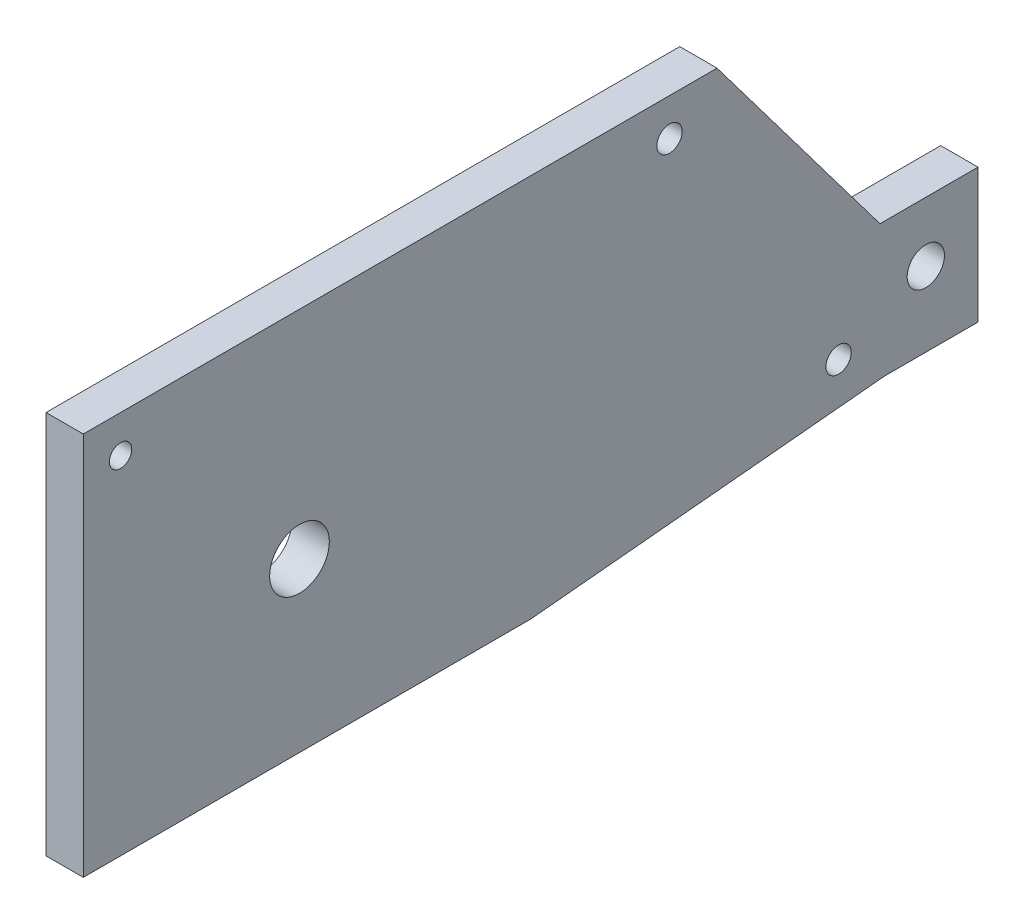
ISO-10303-21;
HEADER;
FILE_DESCRIPTION(('STEP AP214'),'2;1');
FILE_NAME('part.step','',(''),(''),'','','');
FILE_SCHEMA(('AUTOMOTIVE_DESIGN { 1 0 10303 214 1 1 1 1 }'));
ENDSEC;
DATA;
#1=APPLICATION_CONTEXT('core data for automotive mechanical design processes');
#2=APPLICATION_PROTOCOL_DEFINITION('international standard','automotive_design',2000,#1);
#3=PRODUCT_CONTEXT('',#1,'mechanical');
#4=PRODUCT('Part','Part','',(#3));
#5=PRODUCT_RELATED_PRODUCT_CATEGORY('part','',(#4));
#6=PRODUCT_DEFINITION_FORMATION('','',#4);
#7=PRODUCT_DEFINITION_CONTEXT('part definition',#1,'design');
#8=PRODUCT_DEFINITION('design','',#6,#7);
#9=PRODUCT_DEFINITION_SHAPE('','',#8);
#10=(LENGTH_UNIT() NAMED_UNIT(*) SI_UNIT(.MILLI.,.METRE.));
#11=(NAMED_UNIT(*) PLANE_ANGLE_UNIT() SI_UNIT($,.RADIAN.));
#12=(NAMED_UNIT(*) SI_UNIT($,.STERADIAN.) SOLID_ANGLE_UNIT());
#13=UNCERTAINTY_MEASURE_WITH_UNIT(LENGTH_MEASURE(1.E-05),#10,'distance_accuracy_value','');
#14=(GEOMETRIC_REPRESENTATION_CONTEXT(3) GLOBAL_UNCERTAINTY_ASSIGNED_CONTEXT((#13)) GLOBAL_UNIT_ASSIGNED_CONTEXT((#10,
#11,#12)) REPRESENTATION_CONTEXT('',''));
#15=CARTESIAN_POINT('',(0.,0.,0.));
#16=DIRECTION('',(0.,0.,1.));
#17=DIRECTION('',(1.,0.,0.));
#18=AXIS2_PLACEMENT_3D('',#15,#16,#17);
#19=CARTESIAN_POINT('',(5.,-25.75,60.));
#20=DIRECTION('',(0.,0.,-1.));
#21=DIRECTION('',(-1.,0.,0.));
#22=AXIS2_PLACEMENT_3D('',#19,#20,#21);
#23=PLANE('',#22);
#24=DIRECTION('',(0.,-1.,0.));
#25=VECTOR('',#24,1.);
#26=CARTESIAN_POINT('',(0.,-25.75,60.));
#27=LINE('',#26,#25);
#28=CARTESIAN_POINT('',(0.,25.75,60.));
#29=VERTEX_POINT('',#28);
#30=CARTESIAN_POINT('',(0.,-25.75,60.));
#31=VERTEX_POINT('',#30);
#32=EDGE_CURVE('E171',#29,#31,#27,.T.);
#33=ORIENTED_EDGE('',*,*,#32,.T.);
#34=DIRECTION('',(-1.,0.,0.));
#35=VECTOR('',#34,1.);
#36=CARTESIAN_POINT('',(5.,-25.75,60.));
#37=LINE('',#36,#35);
#38=CARTESIAN_POINT('',(5.,-25.75,60.));
#39=VERTEX_POINT('',#38);
#40=EDGE_CURVE('E11',#39,#31,#37,.T.);
#41=ORIENTED_EDGE('',*,*,#40,.F.);
#42=DIRECTION('',(0.,-1.,0.));
#43=VECTOR('',#42,1.);
#44=CARTESIAN_POINT('',(5.,-25.75,60.));
#45=LINE('',#44,#43);
#46=CARTESIAN_POINT('',(5.,25.75,60.));
#47=VERTEX_POINT('',#46);
#48=EDGE_CURVE('E172',#47,#39,#45,.T.);
#49=ORIENTED_EDGE('',*,*,#48,.F.);
#50=DIRECTION('',(-1.,0.,0.));
#51=VECTOR('',#50,1.);
#52=CARTESIAN_POINT('',(5.,25.75,60.));
#53=LINE('',#52,#51);
#54=EDGE_CURVE('E45',#47,#29,#53,.T.);
#55=ORIENTED_EDGE('',*,*,#54,.T.);
#56=EDGE_LOOP('',(#33,#41,#49,#55));
#57=FACE_BOUND('',#56,.T.);
#58=ADVANCED_FACE('F37',(#57),#23,.F.);
#59=CARTESIAN_POINT('',(5.,-25.75,-60.));
#60=DIRECTION('',(0.,1.,0.));
#61=DIRECTION('',(0.,0.,1.));
#62=AXIS2_PLACEMENT_3D('',#59,#60,#61);
#63=PLANE('',#62);
#64=DIRECTION('',(0.,0.,-1.));
#65=VECTOR('',#64,1.);
#66=CARTESIAN_POINT('',(0.,-25.75,-60.));
#67=LINE('',#66,#65);
#68=CARTESIAN_POINT('',(0.,-25.75,3.59304599961696E-13));
#69=VERTEX_POINT('',#68);
#70=EDGE_CURVE('E185',#31,#69,#67,.T.);
#71=ORIENTED_EDGE('',*,*,#70,.T.);
#72=DIRECTION('',(1.,0.,0.));
#73=VECTOR('',#72,1.);
#74=CARTESIAN_POINT('',(-0.00100000000000013,-25.75,0.));
#75=LINE('',#74,#73);
#76=CARTESIAN_POINT('',(5.,-25.75,0.));
#77=VERTEX_POINT('',#76);
#78=EDGE_CURVE('E52',#69,#77,#75,.T.);
#79=ORIENTED_EDGE('',*,*,#78,.T.);
#80=DIRECTION('',(0.,0.,-1.));
#81=VECTOR('',#80,1.);
#82=CARTESIAN_POINT('',(5.,-25.75,-60.));
#83=LINE('',#82,#81);
#84=EDGE_CURVE('E175',#39,#77,#83,.T.);
#85=ORIENTED_EDGE('',*,*,#84,.F.);
#86=ORIENTED_EDGE('',*,*,#40,.T.);
#87=EDGE_LOOP('',(#71,#79,#85,#86));
#88=FACE_BOUND('',#87,.T.);
#89=ADVANCED_FACE('F200',(#88),#63,.F.);
#90=CARTESIAN_POINT('',(5.,-25.75,-60.));
#91=DIRECTION('',(0.,0.,1.));
#92=DIRECTION('',(1.,0.,0.));
#93=AXIS2_PLACEMENT_3D('',#90,#91,#92);
#94=PLANE('',#93);
#95=DIRECTION('',(0.,1.,0.));
#96=VECTOR('',#95,1.);
#97=CARTESIAN_POINT('',(5.,-25.75,-60.));
#98=LINE('',#97,#96);
#99=CARTESIAN_POINT('',(5.,-21.25,-60.));
#100=VERTEX_POINT('',#99);
#101=CARTESIAN_POINT('',(5.,-3.25,-60.));
#102=VERTEX_POINT('',#101);
#103=EDGE_CURVE('E179',#100,#102,#98,.T.);
#104=ORIENTED_EDGE('',*,*,#103,.F.);
#105=DIRECTION('',(1.,0.,0.));
#106=VECTOR('',#105,1.);
#107=CARTESIAN_POINT('',(-0.00100000000000013,-21.25,-60.));
#108=LINE('',#107,#106);
#109=CARTESIAN_POINT('',(0.,-21.25,-60.));
#110=VERTEX_POINT('',#109);
#111=EDGE_CURVE('E118',#110,#100,#108,.T.);
#112=ORIENTED_EDGE('',*,*,#111,.F.);
#113=DIRECTION('',(0.,1.,0.));
#114=VECTOR('',#113,1.);
#115=CARTESIAN_POINT('',(0.,-25.75,-60.));
#116=LINE('',#115,#114);
#117=CARTESIAN_POINT('',(0.,-3.25,-60.));
#118=VERTEX_POINT('',#117);
#119=EDGE_CURVE('E122',#110,#118,#116,.T.);
#120=ORIENTED_EDGE('',*,*,#119,.T.);
#121=DIRECTION('',(1.,0.,0.));
#122=VECTOR('',#121,1.);
#123=CARTESIAN_POINT('',(-0.00100000000000013,-3.25,-60.));
#124=LINE('',#123,#122);
#125=EDGE_CURVE('E163',#118,#102,#124,.T.);
#126=ORIENTED_EDGE('',*,*,#125,.T.);
#127=EDGE_LOOP('',(#104,#112,#120,#126));
#128=FACE_BOUND('',#127,.T.);
#129=ADVANCED_FACE('F213',(#128),#94,.F.);
#130=CARTESIAN_POINT('',(5.,25.75,-60.));
#131=DIRECTION('',(0.,-1.,0.));
#132=DIRECTION('',(0.,0.,-1.));
#133=AXIS2_PLACEMENT_3D('',#130,#131,#132);
#134=PLANE('',#133);
#135=DIRECTION('',(0.,0.,1.));
#136=VECTOR('',#135,1.);
#137=CARTESIAN_POINT('',(5.,25.75,-60.));
#138=LINE('',#137,#136);
#139=CARTESIAN_POINT('',(5.,25.75,-25.));
#140=VERTEX_POINT('',#139);
#141=EDGE_CURVE('E181',#140,#47,#138,.T.);
#142=ORIENTED_EDGE('',*,*,#141,.F.);
#143=DIRECTION('',(1.,0.,0.));
#144=VECTOR('',#143,1.);
#145=CARTESIAN_POINT('',(-0.00100000000000013,25.75,-25.));
#146=LINE('',#145,#144);
#147=CARTESIAN_POINT('',(0.,25.75,-25.));
#148=VERTEX_POINT('',#147);
#149=EDGE_CURVE('E162',#148,#140,#146,.T.);
#150=ORIENTED_EDGE('',*,*,#149,.F.);
#151=DIRECTION('',(0.,0.,1.));
#152=VECTOR('',#151,1.);
#153=CARTESIAN_POINT('',(0.,25.75,-60.));
#154=LINE('',#153,#152);
#155=EDGE_CURVE('E176',#148,#29,#154,.T.);
#156=ORIENTED_EDGE('',*,*,#155,.T.);
#157=ORIENTED_EDGE('',*,*,#54,.F.);
#158=EDGE_LOOP('',(#142,#150,#156,#157));
#159=FACE_BOUND('',#158,.T.);
#160=ADVANCED_FACE('F207',(#159),#134,.F.);
#161=CARTESIAN_POINT('',(5.,0.,0.));
#162=DIRECTION('',(1.,0.,0.));
#163=DIRECTION('',(0.,0.,-1.));
#164=AXIS2_PLACEMENT_3D('',#161,#162,#163);
#165=PLANE('',#164);
#166=CARTESIAN_POINT('',(5.,-11.25,-53.));
#167=DIRECTION('',(1.,0.,0.));
#168=DIRECTION('',(0.,0.,-1.));
#169=AXIS2_PLACEMENT_3D('',#166,#167,#168);
#170=CIRCLE('',#169,2.5);
#171=CARTESIAN_POINT('',(5.,-11.25,-55.5));
#172=VERTEX_POINT('',#171);
#173=EDGE_CURVE('E126',#172,#172,#170,.T.);
#174=ORIENTED_EDGE('',*,*,#173,.F.);
#175=EDGE_LOOP('',(#174));
#176=FACE_BOUND('',#175,.T.);
#177=DIRECTION('',(0.,0.,1.));
#178=VECTOR('',#177,1.);
#179=CARTESIAN_POINT('',(5.,-21.25,-60.));
#180=LINE('',#179,#178);
#181=CARTESIAN_POINT('',(5.,-21.25,-47.5));
#182=VERTEX_POINT('',#181);
#183=EDGE_CURVE('E109',#100,#182,#180,.T.);
#184=ORIENTED_EDGE('',*,*,#183,.F.);
#185=ORIENTED_EDGE('',*,*,#103,.T.);
#186=DIRECTION('',(0.,0.,-1.));
#187=VECTOR('',#186,1.);
#188=CARTESIAN_POINT('',(5.,-3.25,-46.853067452981));
#189=LINE('',#188,#187);
#190=CARTESIAN_POINT('',(5.,-3.25,-46.853067452981));
#191=VERTEX_POINT('',#190);
#192=EDGE_CURVE('E159',#191,#102,#189,.T.);
#193=ORIENTED_EDGE('',*,*,#192,.F.);
#194=DIRECTION('',(0.,-0.798635510047294,-0.601815023152047));
#195=VECTOR('',#194,1.);
#196=CARTESIAN_POINT('',(5.,25.75,-25.));
#197=LINE('',#196,#195);
#198=EDGE_CURVE('E156',#140,#191,#197,.T.);
#199=ORIENTED_EDGE('',*,*,#198,.F.);
#200=ORIENTED_EDGE('',*,*,#141,.T.);
#201=ORIENTED_EDGE('',*,*,#48,.T.);
#202=ORIENTED_EDGE('',*,*,#84,.T.);
#203=DIRECTION('',(0.,-0.0943145477204159,0.995542448159943));
#204=VECTOR('',#203,1.);
#205=CARTESIAN_POINT('',(5.,-21.25,-47.5));
#206=LINE('',#205,#204);
#207=EDGE_CURVE('E111',#182,#77,#206,.T.);
#208=ORIENTED_EDGE('',*,*,#207,.F.);
#209=EDGE_LOOP('',(#184,#185,#193,#199,#200,#201,#202,#208));
#210=FACE_BOUND('',#209,.T.);
#211=CARTESIAN_POINT('',(5.,20.7499999999997,-18.6237237211257));
#212=DIRECTION('',(1.,0.,0.));
#213=DIRECTION('',(0.,0.,-1.));
#214=AXIS2_PLACEMENT_3D('',#211,#212,#213);
#215=CIRCLE('',#214,1.69999999999935);
#216=CARTESIAN_POINT('',(5.,20.7499999999997,-20.3237237211251));
#217=VERTEX_POINT('',#216);
#218=EDGE_CURVE('E136',#217,#217,#215,.F.);
#219=ORIENTED_EDGE('',*,*,#218,.T.);
#220=EDGE_LOOP('',(#219));
#221=FACE_BOUND('',#220,.T.);
#222=CARTESIAN_POINT('',(5.,-16.2500000000003,-41.3014773719372));
#223=DIRECTION('',(1.,0.,0.));
#224=DIRECTION('',(0.,0.,-1.));
#225=AXIS2_PLACEMENT_3D('',#222,#223,#224);
#226=CIRCLE('',#225,1.69999999999934);
#227=CARTESIAN_POINT('',(5.,-16.2500000000003,-43.0014773719365));
#228=VERTEX_POINT('',#227);
#229=EDGE_CURVE('E117',#228,#228,#226,.F.);
#230=ORIENTED_EDGE('',*,*,#229,.T.);
#231=EDGE_LOOP('',(#230));
#232=FACE_BOUND('',#231,.T.);
#233=CARTESIAN_POINT('',(5.,20.75,55.));
#234=DIRECTION('',(1.,0.,0.));
#235=DIRECTION('',(0.,0.,-1.));
#236=AXIS2_PLACEMENT_3D('',#233,#234,#235);
#237=CIRCLE('',#236,1.5);
#238=CARTESIAN_POINT('',(5.,20.75,53.5));
#239=VERTEX_POINT('',#238);
#240=EDGE_CURVE('E144',#239,#239,#237,.T.);
#241=ORIENTED_EDGE('',*,*,#240,.F.);
#242=EDGE_LOOP('',(#241));
#243=FACE_BOUND('',#242,.T.);
#244=CARTESIAN_POINT('',(5.,-3.24999999999999,31.));
#245=DIRECTION('',(1.,0.,0.));
#246=DIRECTION('',(0.,0.,-1.));
#247=AXIS2_PLACEMENT_3D('',#244,#245,#246);
#248=CIRCLE('',#247,4.);
#249=CARTESIAN_POINT('',(5.,-3.24999999999999,27.));
#250=VERTEX_POINT('',#249);
#251=EDGE_CURVE('E135',#250,#250,#248,.T.);
#252=ORIENTED_EDGE('',*,*,#251,.F.);
#253=EDGE_LOOP('',(#252));
#254=FACE_BOUND('',#253,.T.);
#255=ADVANCED_FACE('F202',(#176,#210,#221,#232,#243,#254),#165,.T.);
#256=CARTESIAN_POINT('',(0.,0.,0.));
#257=DIRECTION('',(1.,0.,0.));
#258=DIRECTION('',(0.,0.,-1.));
#259=AXIS2_PLACEMENT_3D('',#256,#257,#258);
#260=PLANE('',#259);
#261=CARTESIAN_POINT('',(0.,-11.25,-53.));
#262=DIRECTION('',(1.,0.,0.));
#263=DIRECTION('',(0.,0.,-1.));
#264=AXIS2_PLACEMENT_3D('',#261,#262,#263);
#265=CIRCLE('',#264,2.5);
#266=CARTESIAN_POINT('',(0.,-11.25,-55.5));
#267=VERTEX_POINT('',#266);
#268=EDGE_CURVE('E40',#267,#267,#265,.T.);
#269=ORIENTED_EDGE('',*,*,#268,.T.);
#270=EDGE_LOOP('',(#269));
#271=FACE_BOUND('',#270,.T.);
#272=CARTESIAN_POINT('',(0.,20.7499999999997,-18.6237237211257));
#273=DIRECTION('',(-1.,0.,0.));
#274=DIRECTION('',(0.,0.,1.));
#275=AXIS2_PLACEMENT_3D('',#272,#273,#274);
#276=CIRCLE('',#275,1.69999999999935);
#277=CARTESIAN_POINT('',(0.,20.7499999999997,-16.9237237211264));
#278=VERTEX_POINT('',#277);
#279=EDGE_CURVE('E132',#278,#278,#276,.T.);
#280=ORIENTED_EDGE('',*,*,#279,.F.);
#281=EDGE_LOOP('',(#280));
#282=FACE_BOUND('',#281,.T.);
#283=CARTESIAN_POINT('',(0.,-16.2500000000003,-41.3014773719372));
#284=DIRECTION('',(-1.,0.,0.));
#285=DIRECTION('',(0.,0.,1.));
#286=AXIS2_PLACEMENT_3D('',#283,#284,#285);
#287=CIRCLE('',#286,1.69999999999934);
#288=CARTESIAN_POINT('',(0.,-16.2500000000003,-39.6014773719379));
#289=VERTEX_POINT('',#288);
#290=EDGE_CURVE('E139',#289,#289,#287,.T.);
#291=ORIENTED_EDGE('',*,*,#290,.F.);
#292=EDGE_LOOP('',(#291));
#293=FACE_BOUND('',#292,.T.);
#294=CARTESIAN_POINT('',(0.,20.75,55.));
#295=DIRECTION('',(1.,0.,0.));
#296=DIRECTION('',(0.,0.,-1.));
#297=AXIS2_PLACEMENT_3D('',#294,#295,#296);
#298=CIRCLE('',#297,1.5);
#299=CARTESIAN_POINT('',(0.,20.75,53.5));
#300=VERTEX_POINT('',#299);
#301=EDGE_CURVE('E147',#300,#300,#298,.F.);
#302=ORIENTED_EDGE('',*,*,#301,.F.);
#303=EDGE_LOOP('',(#302));
#304=FACE_BOUND('',#303,.T.);
#305=CARTESIAN_POINT('',(0.,-3.24999999999999,31.));
#306=DIRECTION('',(1.,0.,0.));
#307=DIRECTION('',(0.,0.,-1.));
#308=AXIS2_PLACEMENT_3D('',#305,#306,#307);
#309=CIRCLE('',#308,4.);
#310=CARTESIAN_POINT('',(0.,-3.24999999999999,27.));
#311=VERTEX_POINT('',#310);
#312=EDGE_CURVE('E148',#311,#311,#309,.F.);
#313=ORIENTED_EDGE('',*,*,#312,.F.);
#314=EDGE_LOOP('',(#313));
#315=FACE_BOUND('',#314,.T.);
#316=ORIENTED_EDGE('',*,*,#119,.F.);
#317=DIRECTION('',(0.,0.,-1.));
#318=VECTOR('',#317,1.);
#319=CARTESIAN_POINT('',(0.,-21.25,-60.));
#320=LINE('',#319,#318);
#321=CARTESIAN_POINT('',(0.,-21.25,-47.5));
#322=VERTEX_POINT('',#321);
#323=EDGE_CURVE('E106',#322,#110,#320,.T.);
#324=ORIENTED_EDGE('',*,*,#323,.F.);
#325=DIRECTION('',(0.,0.0943145477204159,-0.995542448159943));
#326=VECTOR('',#325,1.);
#327=CARTESIAN_POINT('',(0.,-21.25,-47.5));
#328=LINE('',#327,#326);
#329=EDGE_CURVE('E113',#69,#322,#328,.T.);
#330=ORIENTED_EDGE('',*,*,#329,.F.);
#331=ORIENTED_EDGE('',*,*,#70,.F.);
#332=ORIENTED_EDGE('',*,*,#32,.F.);
#333=ORIENTED_EDGE('',*,*,#155,.F.);
#334=DIRECTION('',(0.,0.798635510047294,0.601815023152047));
#335=VECTOR('',#334,1.);
#336=CARTESIAN_POINT('',(0.,25.75,-25.));
#337=LINE('',#336,#335);
#338=CARTESIAN_POINT('',(0.,-3.25,-46.853067452981));
#339=VERTEX_POINT('',#338);
#340=EDGE_CURVE('E166',#339,#148,#337,.T.);
#341=ORIENTED_EDGE('',*,*,#340,.F.);
#342=DIRECTION('',(0.,0.,1.));
#343=VECTOR('',#342,1.);
#344=CARTESIAN_POINT('',(0.,-3.25,-46.853067452981));
#345=LINE('',#344,#343);
#346=EDGE_CURVE('E60',#118,#339,#345,.T.);
#347=ORIENTED_EDGE('',*,*,#346,.F.);
#348=EDGE_LOOP('',(#316,#324,#330,#331,#332,#333,#341,#347));
#349=FACE_BOUND('',#348,.T.);
#350=ADVANCED_FACE('F121',(#271,#282,#293,#304,#315,#349),#260,.F.);
#351=CARTESIAN_POINT('',(-0.00100000000000013,-3.25,-46.853067452981));
#352=DIRECTION('',(0.,-1.,0.));
#353=DIRECTION('',(0.,0.,-1.));
#354=AXIS2_PLACEMENT_3D('',#351,#352,#353);
#355=PLANE('',#354);
#356=ORIENTED_EDGE('',*,*,#346,.T.);
#357=DIRECTION('',(1.,0.,0.));
#358=VECTOR('',#357,1.);
#359=CARTESIAN_POINT('',(-0.00100000000000013,-3.25,-46.853067452981));
#360=LINE('',#359,#358);
#361=EDGE_CURVE('E167',#339,#191,#360,.T.);
#362=ORIENTED_EDGE('',*,*,#361,.T.);
#363=ORIENTED_EDGE('',*,*,#192,.T.);
#364=ORIENTED_EDGE('',*,*,#125,.F.);
#365=EDGE_LOOP('',(#356,#362,#363,#364));
#366=FACE_BOUND('',#365,.T.);
#367=ADVANCED_FACE('F210',(#366),#355,.F.);
#368=CARTESIAN_POINT('',(-0.00100000000000013,25.75,-25.));
#369=DIRECTION('',(0.,-0.601815023152047,0.798635510047294));
#370=DIRECTION('',(0.,-0.798635510047294,-0.601815023152047));
#371=AXIS2_PLACEMENT_3D('',#368,#369,#370);
#372=PLANE('',#371);
#373=ORIENTED_EDGE('',*,*,#340,.T.);
#374=ORIENTED_EDGE('',*,*,#149,.T.);
#375=ORIENTED_EDGE('',*,*,#198,.T.);
#376=ORIENTED_EDGE('',*,*,#361,.F.);
#377=EDGE_LOOP('',(#373,#374,#375,#376));
#378=FACE_BOUND('',#377,.T.);
#379=ADVANCED_FACE('F209',(#378),#372,.F.);
#380=CARTESIAN_POINT('',(-0.00100000000000013,-3.24999999999999,31.));
#381=DIRECTION('',(1.,0.,0.));
#382=DIRECTION('',(0.,0.,-1.));
#383=AXIS2_PLACEMENT_3D('',#380,#381,#382);
#384=CYLINDRICAL_SURFACE('',#383,4.);
#385=ORIENTED_EDGE('',*,*,#251,.T.);
#386=EDGE_LOOP('',(#385));
#387=FACE_BOUND('',#386,.T.);
#388=ORIENTED_EDGE('',*,*,#312,.T.);
#389=EDGE_LOOP('',(#388));
#390=FACE_BOUND('',#389,.T.);
#391=ADVANCED_FACE('F302',(#387,#390),#384,.F.);
#392=CARTESIAN_POINT('',(-0.00100000000000013,20.75,55.));
#393=DIRECTION('',(1.,0.,0.));
#394=DIRECTION('',(0.,0.,-1.));
#395=AXIS2_PLACEMENT_3D('',#392,#393,#394);
#396=CYLINDRICAL_SURFACE('',#395,1.5);
#397=ORIENTED_EDGE('',*,*,#240,.T.);
#398=EDGE_LOOP('',(#397));
#399=FACE_BOUND('',#398,.T.);
#400=ORIENTED_EDGE('',*,*,#301,.T.);
#401=EDGE_LOOP('',(#400));
#402=FACE_BOUND('',#401,.T.);
#403=ADVANCED_FACE('F298',(#399,#402),#396,.F.);
#404=CARTESIAN_POINT('',(5.001,-16.2500000000003,-41.3014773719372));
#405=DIRECTION('',(-1.,0.,0.));
#406=DIRECTION('',(0.,0.,1.));
#407=AXIS2_PLACEMENT_3D('',#404,#405,#406);
#408=CYLINDRICAL_SURFACE('',#407,1.69999999999934);
#409=ORIENTED_EDGE('',*,*,#229,.F.);
#410=EDGE_LOOP('',(#409));
#411=FACE_BOUND('',#410,.T.);
#412=ORIENTED_EDGE('',*,*,#290,.T.);
#413=EDGE_LOOP('',(#412));
#414=FACE_BOUND('',#413,.T.);
#415=ADVANCED_FACE('F294',(#411,#414),#408,.F.);
#416=CARTESIAN_POINT('',(5.001,20.7499999999997,-18.6237237211257));
#417=DIRECTION('',(-1.,0.,0.));
#418=DIRECTION('',(0.,0.,1.));
#419=AXIS2_PLACEMENT_3D('',#416,#417,#418);
#420=CYLINDRICAL_SURFACE('',#419,1.69999999999935);
#421=ORIENTED_EDGE('',*,*,#218,.F.);
#422=EDGE_LOOP('',(#421));
#423=FACE_BOUND('',#422,.T.);
#424=ORIENTED_EDGE('',*,*,#279,.T.);
#425=EDGE_LOOP('',(#424));
#426=FACE_BOUND('',#425,.T.);
#427=ADVANCED_FACE('F235',(#423,#426),#420,.F.);
#428=CARTESIAN_POINT('',(-0.00100000000000013,-21.25,-60.));
#429=DIRECTION('',(0.,1.,0.));
#430=DIRECTION('',(0.,0.,1.));
#431=AXIS2_PLACEMENT_3D('',#428,#429,#430);
#432=PLANE('',#431);
#433=ORIENTED_EDGE('',*,*,#323,.T.);
#434=ORIENTED_EDGE('',*,*,#111,.T.);
#435=ORIENTED_EDGE('',*,*,#183,.T.);
#436=DIRECTION('',(1.,0.,0.));
#437=VECTOR('',#436,1.);
#438=CARTESIAN_POINT('',(-0.00100000000000013,-21.25,-47.5));
#439=LINE('',#438,#437);
#440=EDGE_CURVE('E103',#322,#182,#439,.T.);
#441=ORIENTED_EDGE('',*,*,#440,.F.);
#442=EDGE_LOOP('',(#433,#434,#435,#441));
#443=FACE_BOUND('',#442,.T.);
#444=ADVANCED_FACE('F104',(#443),#432,.F.);
#445=CARTESIAN_POINT('',(-0.00100000000000013,-21.25,-47.5));
#446=DIRECTION('',(0.,0.995542448159943,0.0943145477204159));
#447=DIRECTION('',(0.,-0.0943145477204159,0.995542448159943));
#448=AXIS2_PLACEMENT_3D('',#445,#446,#447);
#449=PLANE('',#448);
#450=ORIENTED_EDGE('',*,*,#329,.T.);
#451=ORIENTED_EDGE('',*,*,#440,.T.);
#452=ORIENTED_EDGE('',*,*,#207,.T.);
#453=ORIENTED_EDGE('',*,*,#78,.F.);
#454=EDGE_LOOP('',(#450,#451,#452,#453));
#455=FACE_BOUND('',#454,.T.);
#456=ADVANCED_FACE('F114',(#455),#449,.F.);
#457=CARTESIAN_POINT('',(-5.,-11.25,-53.));
#458=DIRECTION('',(1.,0.,0.));
#459=DIRECTION('',(0.,0.,-1.));
#460=AXIS2_PLACEMENT_3D('',#457,#458,#459);
#461=CYLINDRICAL_SURFACE('',#460,2.5);
#462=ORIENTED_EDGE('',*,*,#173,.T.);
#463=EDGE_LOOP('',(#462));
#464=FACE_BOUND('',#463,.T.);
#465=ORIENTED_EDGE('',*,*,#268,.F.);
#466=EDGE_LOOP('',(#465));
#467=FACE_BOUND('',#466,.T.);
#468=ADVANCED_FACE('F257',(#464,#467),#461,.F.);
#469=CLOSED_SHELL('',(#58,#89,#129,#160,#255,#350,#367,#379,#391,#403,#415,#427,#444,#456,#468));
#470=MANIFOLD_SOLID_BREP('B2',#469);
#471=ADVANCED_BREP_SHAPE_REPRESENTATION('',(#18,#470),#14);
#472=SHAPE_DEFINITION_REPRESENTATION(#9,#471);
ENDSEC;
END-ISO-10303-21;
